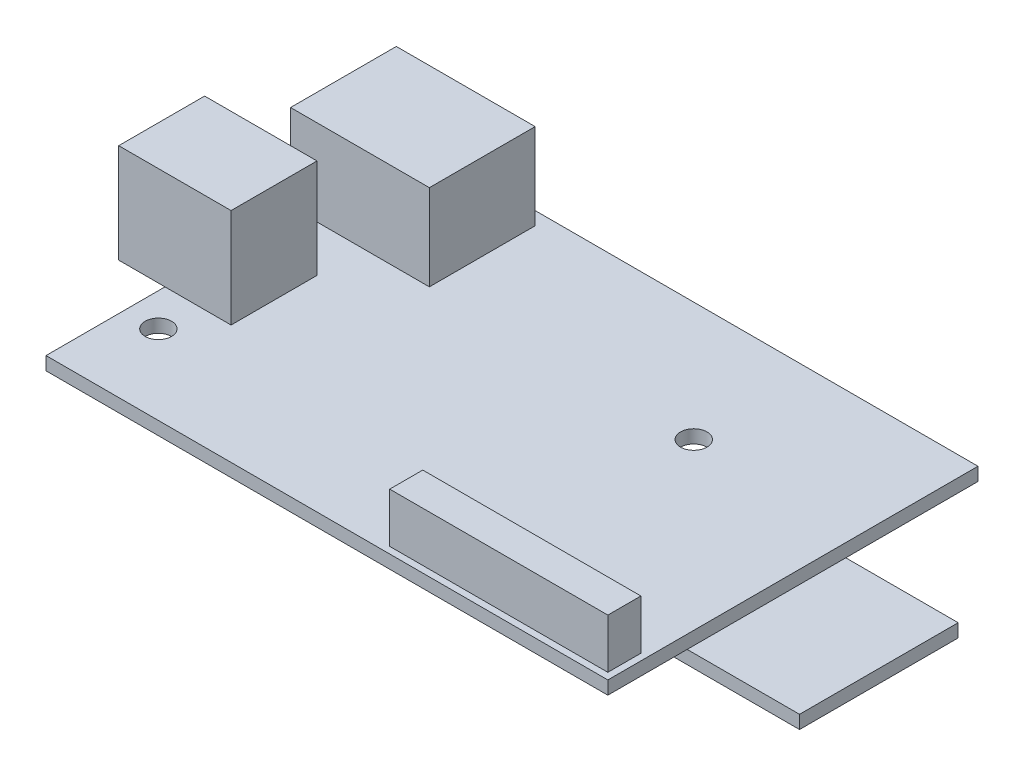
ISO-10303-21;
HEADER;
FILE_DESCRIPTION(('STEP AP214'),'2;1');
FILE_NAME('part.step','',(''),(''),'','','');
FILE_SCHEMA(('AUTOMOTIVE_DESIGN { 1 0 10303 214 1 1 1 1 }'));
ENDSEC;
DATA;
#1=APPLICATION_CONTEXT('core data for automotive mechanical design processes');
#2=APPLICATION_PROTOCOL_DEFINITION('international standard','automotive_design',2000,#1);
#3=PRODUCT_CONTEXT('',#1,'mechanical');
#4=PRODUCT('Part','Part','',(#3));
#5=PRODUCT_RELATED_PRODUCT_CATEGORY('part','',(#4));
#6=PRODUCT_DEFINITION_FORMATION('','',#4);
#7=PRODUCT_DEFINITION_CONTEXT('part definition',#1,'design');
#8=PRODUCT_DEFINITION('design','',#6,#7);
#9=PRODUCT_DEFINITION_SHAPE('','',#8);
#10=(LENGTH_UNIT() NAMED_UNIT(*) SI_UNIT(.MILLI.,.METRE.));
#11=(NAMED_UNIT(*) PLANE_ANGLE_UNIT() SI_UNIT($,.RADIAN.));
#12=(NAMED_UNIT(*) SI_UNIT($,.STERADIAN.) SOLID_ANGLE_UNIT());
#13=UNCERTAINTY_MEASURE_WITH_UNIT(LENGTH_MEASURE(1.E-05),#10,'distance_accuracy_value','');
#14=(GEOMETRIC_REPRESENTATION_CONTEXT(3) GLOBAL_UNCERTAINTY_ASSIGNED_CONTEXT((#13)) GLOBAL_UNIT_ASSIGNED_CONTEXT((#10,
#11,#12)) REPRESENTATION_CONTEXT('',''));
#15=CARTESIAN_POINT('',(0.,0.,0.));
#16=DIRECTION('',(0.,0.,1.));
#17=DIRECTION('',(1.,0.,0.));
#18=AXIS2_PLACEMENT_3D('',#15,#16,#17);
#19=CARTESIAN_POINT('',(0.,2.,0.));
#20=DIRECTION('',(0.,-1.,0.));
#21=DIRECTION('',(0.,0.,-1.));
#22=AXIS2_PLACEMENT_3D('',#19,#20,#21);
#23=PLANE('',#22);
#24=DIRECTION('',(1.,0.,0.));
#25=VECTOR('',#24,1.);
#26=CARTESIAN_POINT('',(-7.,2.,-18.));
#27=LINE('',#26,#25);
#28=CARTESIAN_POINT('',(0.,2.,-18.));
#29=VERTEX_POINT('',#28);
#30=CARTESIAN_POINT('',(10.,2.,-18.));
#31=VERTEX_POINT('',#30);
#32=EDGE_CURVE('E275',#29,#31,#27,.T.);
#33=ORIENTED_EDGE('',*,*,#32,.F.);
#34=DIRECTION('',(0.,0.,1.));
#35=VECTOR('',#34,1.);
#36=CARTESIAN_POINT('',(0.,2.,0.));
#37=LINE('',#36,#35);
#38=CARTESIAN_POINT('',(0.,2.,0.));
#39=VERTEX_POINT('',#38);
#40=EDGE_CURVE('E336',#29,#39,#37,.T.);
#41=ORIENTED_EDGE('',*,*,#40,.T.);
#42=DIRECTION('',(1.,0.,0.));
#43=VECTOR('',#42,1.);
#44=CARTESIAN_POINT('',(0.,2.,0.));
#45=LINE('',#44,#43);
#46=CARTESIAN_POINT('',(85.,2.,0.));
#47=VERTEX_POINT('',#46);
#48=EDGE_CURVE('E334',#39,#47,#45,.T.);
#49=ORIENTED_EDGE('',*,*,#48,.T.);
#50=DIRECTION('',(0.,0.,-1.));
#51=VECTOR('',#50,1.);
#52=CARTESIAN_POINT('',(85.,2.,0.));
#53=LINE('',#52,#51);
#54=CARTESIAN_POINT('',(85.,2.,-56.));
#55=VERTEX_POINT('',#54);
#56=EDGE_CURVE('E338',#47,#55,#53,.T.);
#57=ORIENTED_EDGE('',*,*,#56,.T.);
#58=DIRECTION('',(-1.,0.,0.));
#59=VECTOR('',#58,1.);
#60=CARTESIAN_POINT('',(0.,2.,-56.));
#61=LINE('',#60,#59);
#62=CARTESIAN_POINT('',(0.,2.,-56.));
#63=VERTEX_POINT('',#62);
#64=EDGE_CURVE('E340',#55,#63,#61,.T.);
#65=ORIENTED_EDGE('',*,*,#64,.T.);
#66=CARTESIAN_POINT('',(0.,2.,-54.));
#67=VERTEX_POINT('',#66);
#68=EDGE_CURVE('E331',#63,#67,#37,.T.);
#69=ORIENTED_EDGE('',*,*,#68,.T.);
#70=DIRECTION('',(-1.,0.,0.));
#71=VECTOR('',#70,1.);
#72=CARTESIAN_POINT('',(-1.,2.,-54.));
#73=LINE('',#72,#71);
#74=CARTESIAN_POINT('',(20.,2.,-54.));
#75=VERTEX_POINT('',#74);
#76=EDGE_CURVE('E301',#75,#67,#73,.T.);
#77=ORIENTED_EDGE('',*,*,#76,.F.);
#78=DIRECTION('',(0.,0.,-1.));
#79=VECTOR('',#78,1.);
#80=CARTESIAN_POINT('',(20.,2.,-54.));
#81=LINE('',#80,#79);
#82=CARTESIAN_POINT('',(20.,2.,-38.));
#83=VERTEX_POINT('',#82);
#84=EDGE_CURVE('E313',#83,#75,#81,.T.);
#85=ORIENTED_EDGE('',*,*,#84,.F.);
#86=DIRECTION('',(1.,0.,0.));
#87=VECTOR('',#86,1.);
#88=CARTESIAN_POINT('',(-0.999999999999998,2.,-38.));
#89=LINE('',#88,#87);
#90=CARTESIAN_POINT('',(0.,2.,-38.));
#91=VERTEX_POINT('',#90);
#92=EDGE_CURVE('E43',#91,#83,#89,.T.);
#93=ORIENTED_EDGE('',*,*,#92,.F.);
#94=CARTESIAN_POINT('',(0.,2.,-31.));
#95=VERTEX_POINT('',#94);
#96=EDGE_CURVE('E394',#91,#95,#37,.T.);
#97=ORIENTED_EDGE('',*,*,#96,.T.);
#98=DIRECTION('',(-1.,0.,0.));
#99=VECTOR('',#98,1.);
#100=CARTESIAN_POINT('',(-7.,2.,-31.));
#101=LINE('',#100,#99);
#102=CARTESIAN_POINT('',(10.,2.,-31.));
#103=VERTEX_POINT('',#102);
#104=EDGE_CURVE('E266',#103,#95,#101,.T.);
#105=ORIENTED_EDGE('',*,*,#104,.F.);
#106=DIRECTION('',(0.,0.,-1.));
#107=VECTOR('',#106,1.);
#108=CARTESIAN_POINT('',(10.,2.,-31.));
#109=LINE('',#108,#107);
#110=EDGE_CURVE('E279',#31,#103,#109,.T.);
#111=ORIENTED_EDGE('',*,*,#110,.F.);
#112=EDGE_LOOP('',(#33,#41,#49,#57,#65,#69,#77,#85,#93,#97,#105,#111));
#113=FACE_BOUND('',#112,.T.);
#114=CARTESIAN_POINT('',(60.,2.,-38.));
#115=DIRECTION('',(0.,1.,0.));
#116=DIRECTION('',(0.,0.,1.));
#117=AXIS2_PLACEMENT_3D('',#114,#115,#116);
#118=CIRCLE('',#117,2.);
#119=CARTESIAN_POINT('',(60.,2.,-36.));
#120=VERTEX_POINT('',#119);
#121=EDGE_CURVE('E216',#120,#120,#118,.T.);
#122=ORIENTED_EDGE('',*,*,#121,.F.);
#123=EDGE_LOOP('',(#122));
#124=FACE_BOUND('',#123,.T.);
#125=CARTESIAN_POINT('',(5.,2.,-12.));
#126=DIRECTION('',(0.,1.,0.));
#127=DIRECTION('',(0.,0.,1.));
#128=AXIS2_PLACEMENT_3D('',#125,#126,#127);
#129=CIRCLE('',#128,2.);
#130=CARTESIAN_POINT('',(5.,2.,-10.));
#131=VERTEX_POINT('',#130);
#132=EDGE_CURVE('E222',#131,#131,#129,.T.);
#133=ORIENTED_EDGE('',*,*,#132,.F.);
#134=EDGE_LOOP('',(#133));
#135=FACE_BOUND('',#134,.T.);
#136=DIRECTION('',(0.,0.,1.));
#137=VECTOR('',#136,1.);
#138=CARTESIAN_POINT('',(51.,2.,-6.));
#139=LINE('',#138,#137);
#140=CARTESIAN_POINT('',(51.,2.,-6.));
#141=VERTEX_POINT('',#140);
#142=CARTESIAN_POINT('',(51.,2.,-1.));
#143=VERTEX_POINT('',#142);
#144=EDGE_CURVE('E212',#141,#143,#139,.T.);
#145=ORIENTED_EDGE('',*,*,#144,.F.);
#146=DIRECTION('',(-1.,0.,0.));
#147=VECTOR('',#146,1.);
#148=CARTESIAN_POINT('',(51.,2.,-6.));
#149=LINE('',#148,#147);
#150=CARTESIAN_POINT('',(84.,2.,-6.));
#151=VERTEX_POINT('',#150);
#152=EDGE_CURVE('E209',#151,#141,#149,.T.);
#153=ORIENTED_EDGE('',*,*,#152,.F.);
#154=DIRECTION('',(0.,0.,-1.));
#155=VECTOR('',#154,1.);
#156=CARTESIAN_POINT('',(84.,2.,-6.));
#157=LINE('',#156,#155);
#158=CARTESIAN_POINT('',(84.,2.,-1.));
#159=VERTEX_POINT('',#158);
#160=EDGE_CURVE('E57',#159,#151,#157,.T.);
#161=ORIENTED_EDGE('',*,*,#160,.F.);
#162=DIRECTION('',(1.,0.,0.));
#163=VECTOR('',#162,1.);
#164=CARTESIAN_POINT('',(51.,2.,-1.));
#165=LINE('',#164,#163);
#166=EDGE_CURVE('E52',#143,#159,#165,.T.);
#167=ORIENTED_EDGE('',*,*,#166,.F.);
#168=EDGE_LOOP('',(#145,#153,#161,#167));
#169=FACE_BOUND('',#168,.T.);
#170=ADVANCED_FACE('F34',(#113,#124,#135,#169),#23,.F.);
#171=CARTESIAN_POINT('',(0.,2.,0.));
#172=DIRECTION('',(1.,0.,0.));
#173=DIRECTION('',(0.,0.,-1.));
#174=AXIS2_PLACEMENT_3D('',#171,#172,#173);
#175=PLANE('',#174);
#176=DIRECTION('',(0.,0.,1.));
#177=VECTOR('',#176,1.);
#178=CARTESIAN_POINT('',(0.,0.,0.));
#179=LINE('',#178,#177);
#180=CARTESIAN_POINT('',(0.,0.,-56.));
#181=VERTEX_POINT('',#180);
#182=CARTESIAN_POINT('',(0.,0.,0.));
#183=VERTEX_POINT('',#182);
#184=EDGE_CURVE('E330',#181,#183,#179,.T.);
#185=ORIENTED_EDGE('',*,*,#184,.T.);
#186=DIRECTION('',(0.,-1.,0.));
#187=VECTOR('',#186,1.);
#188=CARTESIAN_POINT('',(0.,2.,0.));
#189=LINE('',#188,#187);
#190=EDGE_CURVE('E38',#39,#183,#189,.T.);
#191=ORIENTED_EDGE('',*,*,#190,.F.);
#192=ORIENTED_EDGE('',*,*,#40,.F.);
#193=EDGE_CURVE('E395',#95,#29,#37,.T.);
#194=ORIENTED_EDGE('',*,*,#193,.F.);
#195=ORIENTED_EDGE('',*,*,#96,.F.);
#196=EDGE_CURVE('E335',#67,#91,#37,.T.);
#197=ORIENTED_EDGE('',*,*,#196,.F.);
#198=ORIENTED_EDGE('',*,*,#68,.F.);
#199=DIRECTION('',(0.,-1.,0.));
#200=VECTOR('',#199,1.);
#201=CARTESIAN_POINT('',(0.,2.,-56.));
#202=LINE('',#201,#200);
#203=EDGE_CURVE('E342',#63,#181,#202,.T.);
#204=ORIENTED_EDGE('',*,*,#203,.T.);
#205=EDGE_LOOP('',(#185,#191,#192,#194,#195,#197,#198,#204));
#206=FACE_BOUND('',#205,.T.);
#207=ADVANCED_FACE('F36',(#206),#175,.F.);
#208=CARTESIAN_POINT('',(0.,2.,0.));
#209=DIRECTION('',(0.,0.,-1.));
#210=DIRECTION('',(-1.,0.,0.));
#211=AXIS2_PLACEMENT_3D('',#208,#209,#210);
#212=PLANE('',#211);
#213=DIRECTION('',(1.,0.,0.));
#214=VECTOR('',#213,1.);
#215=CARTESIAN_POINT('',(0.,0.,0.));
#216=LINE('',#215,#214);
#217=CARTESIAN_POINT('',(85.,0.,0.));
#218=VERTEX_POINT('',#217);
#219=EDGE_CURVE('E345',#183,#218,#216,.T.);
#220=ORIENTED_EDGE('',*,*,#219,.T.);
#221=DIRECTION('',(0.,-1.,0.));
#222=VECTOR('',#221,1.);
#223=CARTESIAN_POINT('',(85.,2.,0.));
#224=LINE('',#223,#222);
#225=EDGE_CURVE('E358',#47,#218,#224,.T.);
#226=ORIENTED_EDGE('',*,*,#225,.F.);
#227=ORIENTED_EDGE('',*,*,#48,.F.);
#228=ORIENTED_EDGE('',*,*,#190,.T.);
#229=EDGE_LOOP('',(#220,#226,#227,#228));
#230=FACE_BOUND('',#229,.T.);
#231=ADVANCED_FACE('F402',(#230),#212,.F.);
#232=CARTESIAN_POINT('',(85.,2.,0.));
#233=DIRECTION('',(-1.,0.,0.));
#234=DIRECTION('',(0.,0.,1.));
#235=AXIS2_PLACEMENT_3D('',#232,#233,#234);
#236=PLANE('',#235);
#237=DIRECTION('',(0.,0.,-1.));
#238=VECTOR('',#237,1.);
#239=CARTESIAN_POINT('',(85.,0.,0.));
#240=LINE('',#239,#238);
#241=CARTESIAN_POINT('',(85.,0.,-12.));
#242=VERTEX_POINT('',#241);
#243=EDGE_CURVE('E348',#218,#242,#240,.T.);
#244=ORIENTED_EDGE('',*,*,#243,.T.);
#245=CARTESIAN_POINT('',(85.,0.,-36.));
#246=VERTEX_POINT('',#245);
#247=EDGE_CURVE('E352',#242,#246,#240,.T.);
#248=ORIENTED_EDGE('',*,*,#247,.T.);
#249=CARTESIAN_POINT('',(85.,0.,-56.));
#250=VERTEX_POINT('',#249);
#251=EDGE_CURVE('E347',#246,#250,#240,.T.);
#252=ORIENTED_EDGE('',*,*,#251,.T.);
#253=DIRECTION('',(0.,-1.,0.));
#254=VECTOR('',#253,1.);
#255=CARTESIAN_POINT('',(85.,2.,-56.));
#256=LINE('',#255,#254);
#257=EDGE_CURVE('E356',#55,#250,#256,.T.);
#258=ORIENTED_EDGE('',*,*,#257,.F.);
#259=ORIENTED_EDGE('',*,*,#56,.F.);
#260=ORIENTED_EDGE('',*,*,#225,.T.);
#261=EDGE_LOOP('',(#244,#248,#252,#258,#259,#260));
#262=FACE_BOUND('',#261,.T.);
#263=ADVANCED_FACE('F410',(#262),#236,.F.);
#264=CARTESIAN_POINT('',(0.,2.,-56.));
#265=DIRECTION('',(0.,0.,1.));
#266=DIRECTION('',(1.,0.,0.));
#267=AXIS2_PLACEMENT_3D('',#264,#265,#266);
#268=PLANE('',#267);
#269=DIRECTION('',(-1.,0.,0.));
#270=VECTOR('',#269,1.);
#271=CARTESIAN_POINT('',(0.,0.,-56.));
#272=LINE('',#271,#270);
#273=EDGE_CURVE('E351',#250,#181,#272,.T.);
#274=ORIENTED_EDGE('',*,*,#273,.T.);
#275=ORIENTED_EDGE('',*,*,#203,.F.);
#276=ORIENTED_EDGE('',*,*,#64,.F.);
#277=ORIENTED_EDGE('',*,*,#257,.T.);
#278=EDGE_LOOP('',(#274,#275,#276,#277));
#279=FACE_BOUND('',#278,.T.);
#280=ADVANCED_FACE('F431',(#279),#268,.F.);
#281=CARTESIAN_POINT('',(0.,0.,0.));
#282=DIRECTION('',(0.,-1.,0.));
#283=DIRECTION('',(0.,0.,-1.));
#284=AXIS2_PLACEMENT_3D('',#281,#282,#283);
#285=PLANE('',#284);
#286=CARTESIAN_POINT('',(5.,0.,-12.));
#287=DIRECTION('',(0.,-1.,0.));
#288=DIRECTION('',(0.,0.,-1.));
#289=AXIS2_PLACEMENT_3D('',#286,#287,#288);
#290=CIRCLE('',#289,2.);
#291=CARTESIAN_POINT('',(5.,0.,-14.));
#292=VERTEX_POINT('',#291);
#293=EDGE_CURVE('E226',#292,#292,#290,.F.);
#294=ORIENTED_EDGE('',*,*,#293,.T.);
#295=EDGE_LOOP('',(#294));
#296=FACE_BOUND('',#295,.T.);
#297=CARTESIAN_POINT('',(60.,0.,-38.));
#298=DIRECTION('',(0.,-1.,0.));
#299=DIRECTION('',(0.,0.,-1.));
#300=AXIS2_PLACEMENT_3D('',#297,#298,#299);
#301=CIRCLE('',#300,2.);
#302=CARTESIAN_POINT('',(60.,0.,-40.));
#303=VERTEX_POINT('',#302);
#304=EDGE_CURVE('E213',#303,#303,#301,.F.);
#305=ORIENTED_EDGE('',*,*,#304,.T.);
#306=EDGE_LOOP('',(#305));
#307=FACE_BOUND('',#306,.T.);
#308=DIRECTION('',(-1.,0.,0.));
#309=VECTOR('',#308,1.);
#310=CARTESIAN_POINT('',(69.,0.,-12.));
#311=LINE('',#310,#309);
#312=CARTESIAN_POINT('',(69.,0.,-12.));
#313=VERTEX_POINT('',#312);
#314=EDGE_CURVE('E11',#242,#313,#311,.T.);
#315=ORIENTED_EDGE('',*,*,#314,.F.);
#316=ORIENTED_EDGE('',*,*,#243,.F.);
#317=ORIENTED_EDGE('',*,*,#219,.F.);
#318=ORIENTED_EDGE('',*,*,#184,.F.);
#319=ORIENTED_EDGE('',*,*,#273,.F.);
#320=ORIENTED_EDGE('',*,*,#251,.F.);
#321=DIRECTION('',(1.,0.,0.));
#322=VECTOR('',#321,1.);
#323=CARTESIAN_POINT('',(69.,0.,-36.));
#324=LINE('',#323,#322);
#325=CARTESIAN_POINT('',(69.,0.,-36.));
#326=VERTEX_POINT('',#325);
#327=EDGE_CURVE('E244',#326,#246,#324,.T.);
#328=ORIENTED_EDGE('',*,*,#327,.F.);
#329=DIRECTION('',(0.,0.,-1.));
#330=VECTOR('',#329,1.);
#331=CARTESIAN_POINT('',(69.,0.,-12.));
#332=LINE('',#331,#330);
#333=EDGE_CURVE('E225',#313,#326,#332,.T.);
#334=ORIENTED_EDGE('',*,*,#333,.F.);
#335=EDGE_LOOP('',(#315,#316,#317,#318,#319,#320,#328,#334));
#336=FACE_BOUND('',#335,.T.);
#337=ADVANCED_FACE('F407',(#296,#307,#336),#285,.T.);
#338=CARTESIAN_POINT('',(0.,2.,0.));
#339=DIRECTION('',(0.,1.,0.));
#340=DIRECTION('',(0.,0.,1.));
#341=AXIS2_PLACEMENT_3D('',#338,#339,#340);
#342=PLANE('',#341);
#343=CARTESIAN_POINT('',(-1.,2.,-54.));
#344=VERTEX_POINT('',#343);
#345=EDGE_CURVE('E316',#67,#344,#73,.T.);
#346=ORIENTED_EDGE('',*,*,#345,.F.);
#347=ORIENTED_EDGE('',*,*,#196,.T.);
#348=CARTESIAN_POINT('',(-0.999999999999998,2.,-38.));
#349=VERTEX_POINT('',#348);
#350=EDGE_CURVE('E310',#349,#91,#89,.T.);
#351=ORIENTED_EDGE('',*,*,#350,.F.);
#352=DIRECTION('',(0.,0.,1.));
#353=VECTOR('',#352,1.);
#354=CARTESIAN_POINT('',(-1.,2.,-54.));
#355=LINE('',#354,#353);
#356=EDGE_CURVE('E296',#344,#349,#355,.T.);
#357=ORIENTED_EDGE('',*,*,#356,.F.);
#358=EDGE_LOOP('',(#346,#347,#351,#357));
#359=FACE_BOUND('',#358,.T.);
#360=ADVANCED_FACE('F390',(#359),#342,.F.);
#361=CARTESIAN_POINT('',(-1.,15.,-54.));
#362=DIRECTION('',(1.,0.,0.));
#363=DIRECTION('',(0.,0.,-1.));
#364=AXIS2_PLACEMENT_3D('',#361,#362,#363);
#365=PLANE('',#364);
#366=ORIENTED_EDGE('',*,*,#356,.T.);
#367=DIRECTION('',(0.,-1.,0.));
#368=VECTOR('',#367,1.);
#369=CARTESIAN_POINT('',(-0.999999999999998,15.,-38.));
#370=LINE('',#369,#368);
#371=CARTESIAN_POINT('',(-0.999999999999998,15.,-38.));
#372=VERTEX_POINT('',#371);
#373=EDGE_CURVE('E327',#372,#349,#370,.T.);
#374=ORIENTED_EDGE('',*,*,#373,.F.);
#375=DIRECTION('',(0.,0.,1.));
#376=VECTOR('',#375,1.);
#377=CARTESIAN_POINT('',(-1.,15.,-54.));
#378=LINE('',#377,#376);
#379=CARTESIAN_POINT('',(-1.,15.,-54.));
#380=VERTEX_POINT('',#379);
#381=EDGE_CURVE('E297',#380,#372,#378,.T.);
#382=ORIENTED_EDGE('',*,*,#381,.F.);
#383=DIRECTION('',(0.,-1.,0.));
#384=VECTOR('',#383,1.);
#385=CARTESIAN_POINT('',(-1.,15.,-54.));
#386=LINE('',#385,#384);
#387=EDGE_CURVE('E307',#380,#344,#386,.T.);
#388=ORIENTED_EDGE('',*,*,#387,.T.);
#389=EDGE_LOOP('',(#366,#374,#382,#388));
#390=FACE_BOUND('',#389,.T.);
#391=ADVANCED_FACE('F387',(#390),#365,.F.);
#392=CARTESIAN_POINT('',(-0.999999999999998,15.,-38.));
#393=DIRECTION('',(0.,0.,-1.));
#394=DIRECTION('',(-1.,0.,0.));
#395=AXIS2_PLACEMENT_3D('',#392,#393,#394);
#396=PLANE('',#395);
#397=ORIENTED_EDGE('',*,*,#350,.T.);
#398=ORIENTED_EDGE('',*,*,#92,.T.);
#399=DIRECTION('',(0.,-1.,0.));
#400=VECTOR('',#399,1.);
#401=CARTESIAN_POINT('',(20.,15.,-38.));
#402=LINE('',#401,#400);
#403=CARTESIAN_POINT('',(20.,15.,-38.));
#404=VERTEX_POINT('',#403);
#405=EDGE_CURVE('E324',#404,#83,#402,.T.);
#406=ORIENTED_EDGE('',*,*,#405,.F.);
#407=DIRECTION('',(1.,0.,0.));
#408=VECTOR('',#407,1.);
#409=CARTESIAN_POINT('',(-0.999999999999998,15.,-38.));
#410=LINE('',#409,#408);
#411=EDGE_CURVE('E300',#372,#404,#410,.T.);
#412=ORIENTED_EDGE('',*,*,#411,.F.);
#413=ORIENTED_EDGE('',*,*,#373,.T.);
#414=EDGE_LOOP('',(#397,#398,#406,#412,#413));
#415=FACE_BOUND('',#414,.T.);
#416=ADVANCED_FACE('F371',(#415),#396,.F.);
#417=CARTESIAN_POINT('',(20.,15.,-54.));
#418=DIRECTION('',(-1.,0.,0.));
#419=DIRECTION('',(0.,0.,1.));
#420=AXIS2_PLACEMENT_3D('',#417,#418,#419);
#421=PLANE('',#420);
#422=ORIENTED_EDGE('',*,*,#84,.T.);
#423=DIRECTION('',(0.,-1.,0.));
#424=VECTOR('',#423,1.);
#425=CARTESIAN_POINT('',(20.,15.,-54.));
#426=LINE('',#425,#424);
#427=CARTESIAN_POINT('',(20.,15.,-54.));
#428=VERTEX_POINT('',#427);
#429=EDGE_CURVE('E321',#428,#75,#426,.T.);
#430=ORIENTED_EDGE('',*,*,#429,.F.);
#431=DIRECTION('',(0.,0.,-1.));
#432=VECTOR('',#431,1.);
#433=CARTESIAN_POINT('',(20.,15.,-54.));
#434=LINE('',#433,#432);
#435=EDGE_CURVE('E303',#404,#428,#434,.T.);
#436=ORIENTED_EDGE('',*,*,#435,.F.);
#437=ORIENTED_EDGE('',*,*,#405,.T.);
#438=EDGE_LOOP('',(#422,#430,#436,#437));
#439=FACE_BOUND('',#438,.T.);
#440=ADVANCED_FACE('F377',(#439),#421,.F.);
#441=CARTESIAN_POINT('',(-1.,15.,-54.));
#442=DIRECTION('',(0.,0.,1.));
#443=DIRECTION('',(1.,0.,0.));
#444=AXIS2_PLACEMENT_3D('',#441,#442,#443);
#445=PLANE('',#444);
#446=ORIENTED_EDGE('',*,*,#76,.T.);
#447=ORIENTED_EDGE('',*,*,#345,.T.);
#448=ORIENTED_EDGE('',*,*,#387,.F.);
#449=DIRECTION('',(-1.,0.,0.));
#450=VECTOR('',#449,1.);
#451=CARTESIAN_POINT('',(-1.,15.,-54.));
#452=LINE('',#451,#450);
#453=EDGE_CURVE('E305',#428,#380,#452,.T.);
#454=ORIENTED_EDGE('',*,*,#453,.F.);
#455=ORIENTED_EDGE('',*,*,#429,.T.);
#456=EDGE_LOOP('',(#446,#447,#448,#454,#455));
#457=FACE_BOUND('',#456,.T.);
#458=ADVANCED_FACE('F433',(#457),#445,.F.);
#459=CARTESIAN_POINT('',(0.,15.,0.));
#460=DIRECTION('',(0.,1.,0.));
#461=DIRECTION('',(0.,0.,1.));
#462=AXIS2_PLACEMENT_3D('',#459,#460,#461);
#463=PLANE('',#462);
#464=ORIENTED_EDGE('',*,*,#381,.T.);
#465=ORIENTED_EDGE('',*,*,#411,.T.);
#466=ORIENTED_EDGE('',*,*,#435,.T.);
#467=ORIENTED_EDGE('',*,*,#453,.T.);
#468=EDGE_LOOP('',(#464,#465,#466,#467));
#469=FACE_BOUND('',#468,.T.);
#470=ADVANCED_FACE('F381',(#469),#463,.T.);
#471=CARTESIAN_POINT('',(0.,2.,0.));
#472=DIRECTION('',(0.,1.,0.));
#473=DIRECTION('',(0.,0.,1.));
#474=AXIS2_PLACEMENT_3D('',#471,#472,#473);
#475=PLANE('',#474);
#476=CARTESIAN_POINT('',(-7.,2.,-31.));
#477=VERTEX_POINT('',#476);
#478=EDGE_CURVE('E282',#95,#477,#101,.T.);
#479=ORIENTED_EDGE('',*,*,#478,.F.);
#480=ORIENTED_EDGE('',*,*,#193,.T.);
#481=CARTESIAN_POINT('',(-7.,2.,-18.));
#482=VERTEX_POINT('',#481);
#483=EDGE_CURVE('E276',#482,#29,#27,.T.);
#484=ORIENTED_EDGE('',*,*,#483,.F.);
#485=DIRECTION('',(0.,0.,1.));
#486=VECTOR('',#485,1.);
#487=CARTESIAN_POINT('',(-7.,2.,-31.));
#488=LINE('',#487,#486);
#489=EDGE_CURVE('E261',#477,#482,#488,.T.);
#490=ORIENTED_EDGE('',*,*,#489,.F.);
#491=EDGE_LOOP('',(#479,#480,#484,#490));
#492=FACE_BOUND('',#491,.T.);
#493=ADVANCED_FACE('F440',(#492),#475,.F.);
#494=CARTESIAN_POINT('',(-7.,17.,-31.));
#495=DIRECTION('',(1.,0.,0.));
#496=DIRECTION('',(0.,0.,-1.));
#497=AXIS2_PLACEMENT_3D('',#494,#495,#496);
#498=PLANE('',#497);
#499=ORIENTED_EDGE('',*,*,#489,.T.);
#500=DIRECTION('',(0.,-1.,0.));
#501=VECTOR('',#500,1.);
#502=CARTESIAN_POINT('',(-7.,17.,-18.));
#503=LINE('',#502,#501);
#504=CARTESIAN_POINT('',(-7.,17.,-18.));
#505=VERTEX_POINT('',#504);
#506=EDGE_CURVE('E293',#505,#482,#503,.T.);
#507=ORIENTED_EDGE('',*,*,#506,.F.);
#508=DIRECTION('',(0.,0.,1.));
#509=VECTOR('',#508,1.);
#510=CARTESIAN_POINT('',(-7.,17.,-31.));
#511=LINE('',#510,#509);
#512=CARTESIAN_POINT('',(-7.,17.,-31.));
#513=VERTEX_POINT('',#512);
#514=EDGE_CURVE('E262',#513,#505,#511,.T.);
#515=ORIENTED_EDGE('',*,*,#514,.F.);
#516=DIRECTION('',(0.,-1.,0.));
#517=VECTOR('',#516,1.);
#518=CARTESIAN_POINT('',(-7.,17.,-31.));
#519=LINE('',#518,#517);
#520=EDGE_CURVE('E272',#513,#477,#519,.T.);
#521=ORIENTED_EDGE('',*,*,#520,.T.);
#522=EDGE_LOOP('',(#499,#507,#515,#521));
#523=FACE_BOUND('',#522,.T.);
#524=ADVANCED_FACE('F521',(#523),#498,.F.);
#525=CARTESIAN_POINT('',(-7.,17.,-18.));
#526=DIRECTION('',(0.,0.,-1.));
#527=DIRECTION('',(-1.,0.,0.));
#528=AXIS2_PLACEMENT_3D('',#525,#526,#527);
#529=PLANE('',#528);
#530=ORIENTED_EDGE('',*,*,#483,.T.);
#531=ORIENTED_EDGE('',*,*,#32,.T.);
#532=DIRECTION('',(0.,-1.,0.));
#533=VECTOR('',#532,1.);
#534=CARTESIAN_POINT('',(10.,17.,-18.));
#535=LINE('',#534,#533);
#536=CARTESIAN_POINT('',(10.,17.,-18.));
#537=VERTEX_POINT('',#536);
#538=EDGE_CURVE('E290',#537,#31,#535,.T.);
#539=ORIENTED_EDGE('',*,*,#538,.F.);
#540=DIRECTION('',(1.,0.,0.));
#541=VECTOR('',#540,1.);
#542=CARTESIAN_POINT('',(-7.,17.,-18.));
#543=LINE('',#542,#541);
#544=EDGE_CURVE('E265',#505,#537,#543,.T.);
#545=ORIENTED_EDGE('',*,*,#544,.F.);
#546=ORIENTED_EDGE('',*,*,#506,.T.);
#547=EDGE_LOOP('',(#530,#531,#539,#545,#546));
#548=FACE_BOUND('',#547,.T.);
#549=ADVANCED_FACE('F530',(#548),#529,.F.);
#550=CARTESIAN_POINT('',(10.,17.,-31.));
#551=DIRECTION('',(-1.,0.,0.));
#552=DIRECTION('',(0.,0.,1.));
#553=AXIS2_PLACEMENT_3D('',#550,#551,#552);
#554=PLANE('',#553);
#555=ORIENTED_EDGE('',*,*,#110,.T.);
#556=DIRECTION('',(0.,-1.,0.));
#557=VECTOR('',#556,1.);
#558=CARTESIAN_POINT('',(10.,17.,-31.));
#559=LINE('',#558,#557);
#560=CARTESIAN_POINT('',(10.,17.,-31.));
#561=VERTEX_POINT('',#560);
#562=EDGE_CURVE('E287',#561,#103,#559,.T.);
#563=ORIENTED_EDGE('',*,*,#562,.F.);
#564=DIRECTION('',(0.,0.,-1.));
#565=VECTOR('',#564,1.);
#566=CARTESIAN_POINT('',(10.,17.,-31.));
#567=LINE('',#566,#565);
#568=EDGE_CURVE('E268',#537,#561,#567,.T.);
#569=ORIENTED_EDGE('',*,*,#568,.F.);
#570=ORIENTED_EDGE('',*,*,#538,.T.);
#571=EDGE_LOOP('',(#555,#563,#569,#570));
#572=FACE_BOUND('',#571,.T.);
#573=ADVANCED_FACE('F540',(#572),#554,.F.);
#574=CARTESIAN_POINT('',(-7.,17.,-31.));
#575=DIRECTION('',(0.,0.,1.));
#576=DIRECTION('',(1.,0.,0.));
#577=AXIS2_PLACEMENT_3D('',#574,#575,#576);
#578=PLANE('',#577);
#579=ORIENTED_EDGE('',*,*,#104,.T.);
#580=ORIENTED_EDGE('',*,*,#478,.T.);
#581=ORIENTED_EDGE('',*,*,#520,.F.);
#582=DIRECTION('',(-1.,0.,0.));
#583=VECTOR('',#582,1.);
#584=CARTESIAN_POINT('',(-7.,17.,-31.));
#585=LINE('',#584,#583);
#586=EDGE_CURVE('E270',#561,#513,#585,.T.);
#587=ORIENTED_EDGE('',*,*,#586,.F.);
#588=ORIENTED_EDGE('',*,*,#562,.T.);
#589=EDGE_LOOP('',(#579,#580,#581,#587,#588));
#590=FACE_BOUND('',#589,.T.);
#591=ADVANCED_FACE('F550',(#590),#578,.F.);
#592=CARTESIAN_POINT('',(0.,17.,0.));
#593=DIRECTION('',(0.,1.,0.));
#594=DIRECTION('',(0.,0.,1.));
#595=AXIS2_PLACEMENT_3D('',#592,#593,#594);
#596=PLANE('',#595);
#597=ORIENTED_EDGE('',*,*,#514,.T.);
#598=ORIENTED_EDGE('',*,*,#544,.T.);
#599=ORIENTED_EDGE('',*,*,#568,.T.);
#600=ORIENTED_EDGE('',*,*,#586,.T.);
#601=EDGE_LOOP('',(#597,#598,#599,#600));
#602=FACE_BOUND('',#601,.T.);
#603=ADVANCED_FACE('F559',(#602),#596,.T.);
#604=CARTESIAN_POINT('',(69.,-2.,-12.));
#605=DIRECTION('',(1.,0.,0.));
#606=DIRECTION('',(0.,0.,-1.));
#607=AXIS2_PLACEMENT_3D('',#604,#605,#606);
#608=PLANE('',#607);
#609=ORIENTED_EDGE('',*,*,#333,.T.);
#610=DIRECTION('',(0.,1.,0.));
#611=VECTOR('',#610,1.);
#612=CARTESIAN_POINT('',(69.,-2.,-36.));
#613=LINE('',#612,#611);
#614=CARTESIAN_POINT('',(69.,-2.,-36.));
#615=VERTEX_POINT('',#614);
#616=EDGE_CURVE('E258',#615,#326,#613,.T.);
#617=ORIENTED_EDGE('',*,*,#616,.F.);
#618=DIRECTION('',(0.,0.,-1.));
#619=VECTOR('',#618,1.);
#620=CARTESIAN_POINT('',(69.,-2.,-12.));
#621=LINE('',#620,#619);
#622=CARTESIAN_POINT('',(69.,-2.,-12.));
#623=VERTEX_POINT('',#622);
#624=EDGE_CURVE('E231',#623,#615,#621,.T.);
#625=ORIENTED_EDGE('',*,*,#624,.F.);
#626=DIRECTION('',(0.,1.,0.));
#627=VECTOR('',#626,1.);
#628=CARTESIAN_POINT('',(69.,-2.,-12.));
#629=LINE('',#628,#627);
#630=EDGE_CURVE('E240',#623,#313,#629,.T.);
#631=ORIENTED_EDGE('',*,*,#630,.T.);
#632=EDGE_LOOP('',(#609,#617,#625,#631));
#633=FACE_BOUND('',#632,.T.);
#634=ADVANCED_FACE('F568',(#633),#608,.F.);
#635=CARTESIAN_POINT('',(69.,-2.,-36.));
#636=DIRECTION('',(0.,0.,1.));
#637=DIRECTION('',(1.,0.,0.));
#638=AXIS2_PLACEMENT_3D('',#635,#636,#637);
#639=PLANE('',#638);
#640=ORIENTED_EDGE('',*,*,#327,.T.);
#641=CARTESIAN_POINT('',(102.,0.,-36.));
#642=VERTEX_POINT('',#641);
#643=EDGE_CURVE('E243',#246,#642,#324,.T.);
#644=ORIENTED_EDGE('',*,*,#643,.T.);
#645=DIRECTION('',(0.,1.,0.));
#646=VECTOR('',#645,1.);
#647=CARTESIAN_POINT('',(102.,-2.,-36.));
#648=LINE('',#647,#646);
#649=CARTESIAN_POINT('',(102.,-2.,-36.));
#650=VERTEX_POINT('',#649);
#651=EDGE_CURVE('E255',#650,#642,#648,.T.);
#652=ORIENTED_EDGE('',*,*,#651,.F.);
#653=DIRECTION('',(1.,0.,0.));
#654=VECTOR('',#653,1.);
#655=CARTESIAN_POINT('',(69.,-2.,-36.));
#656=LINE('',#655,#654);
#657=EDGE_CURVE('E234',#615,#650,#656,.T.);
#658=ORIENTED_EDGE('',*,*,#657,.F.);
#659=ORIENTED_EDGE('',*,*,#616,.T.);
#660=EDGE_LOOP('',(#640,#644,#652,#658,#659));
#661=FACE_BOUND('',#660,.T.);
#662=ADVANCED_FACE('F426',(#661),#639,.F.);
#663=CARTESIAN_POINT('',(102.,-2.,-12.));
#664=DIRECTION('',(-1.,0.,0.));
#665=DIRECTION('',(0.,0.,1.));
#666=AXIS2_PLACEMENT_3D('',#663,#664,#665);
#667=PLANE('',#666);
#668=DIRECTION('',(0.,0.,1.));
#669=VECTOR('',#668,1.);
#670=CARTESIAN_POINT('',(102.,0.,-12.));
#671=LINE('',#670,#669);
#672=CARTESIAN_POINT('',(102.,0.,-12.));
#673=VERTEX_POINT('',#672);
#674=EDGE_CURVE('E247',#642,#673,#671,.T.);
#675=ORIENTED_EDGE('',*,*,#674,.T.);
#676=DIRECTION('',(0.,1.,0.));
#677=VECTOR('',#676,1.);
#678=CARTESIAN_POINT('',(102.,-2.,-12.));
#679=LINE('',#678,#677);
#680=CARTESIAN_POINT('',(102.,-2.,-12.));
#681=VERTEX_POINT('',#680);
#682=EDGE_CURVE('E252',#681,#673,#679,.T.);
#683=ORIENTED_EDGE('',*,*,#682,.F.);
#684=DIRECTION('',(0.,0.,1.));
#685=VECTOR('',#684,1.);
#686=CARTESIAN_POINT('',(102.,-2.,-12.));
#687=LINE('',#686,#685);
#688=EDGE_CURVE('E236',#650,#681,#687,.T.);
#689=ORIENTED_EDGE('',*,*,#688,.F.);
#690=ORIENTED_EDGE('',*,*,#651,.T.);
#691=EDGE_LOOP('',(#675,#683,#689,#690));
#692=FACE_BOUND('',#691,.T.);
#693=ADVANCED_FACE('F423',(#692),#667,.F.);
#694=CARTESIAN_POINT('',(69.,-2.,-12.));
#695=DIRECTION('',(0.,0.,-1.));
#696=DIRECTION('',(-1.,0.,0.));
#697=AXIS2_PLACEMENT_3D('',#694,#695,#696);
#698=PLANE('',#697);
#699=EDGE_CURVE('E45',#673,#242,#311,.T.);
#700=ORIENTED_EDGE('',*,*,#699,.T.);
#701=ORIENTED_EDGE('',*,*,#314,.T.);
#702=ORIENTED_EDGE('',*,*,#630,.F.);
#703=DIRECTION('',(-1.,0.,0.));
#704=VECTOR('',#703,1.);
#705=CARTESIAN_POINT('',(69.,-2.,-12.));
#706=LINE('',#705,#704);
#707=EDGE_CURVE('E238',#681,#623,#706,.T.);
#708=ORIENTED_EDGE('',*,*,#707,.F.);
#709=ORIENTED_EDGE('',*,*,#682,.T.);
#710=EDGE_LOOP('',(#700,#701,#702,#708,#709));
#711=FACE_BOUND('',#710,.T.);
#712=ADVANCED_FACE('F417',(#711),#698,.F.);
#713=CARTESIAN_POINT('',(0.,-2.,0.));
#714=DIRECTION('',(0.,-1.,0.));
#715=DIRECTION('',(0.,0.,-1.));
#716=AXIS2_PLACEMENT_3D('',#713,#714,#715);
#717=PLANE('',#716);
#718=ORIENTED_EDGE('',*,*,#624,.T.);
#719=ORIENTED_EDGE('',*,*,#657,.T.);
#720=ORIENTED_EDGE('',*,*,#688,.T.);
#721=ORIENTED_EDGE('',*,*,#707,.T.);
#722=EDGE_LOOP('',(#718,#719,#720,#721));
#723=FACE_BOUND('',#722,.T.);
#724=ADVANCED_FACE('F596',(#723),#717,.T.);
#725=CARTESIAN_POINT('',(0.,0.,0.));
#726=DIRECTION('',(0.,-1.,0.));
#727=DIRECTION('',(0.,0.,-1.));
#728=AXIS2_PLACEMENT_3D('',#725,#726,#727);
#729=PLANE('',#728);
#730=ORIENTED_EDGE('',*,*,#247,.F.);
#731=ORIENTED_EDGE('',*,*,#699,.F.);
#732=ORIENTED_EDGE('',*,*,#674,.F.);
#733=ORIENTED_EDGE('',*,*,#643,.F.);
#734=EDGE_LOOP('',(#730,#731,#732,#733));
#735=FACE_BOUND('',#734,.T.);
#736=ADVANCED_FACE('F414',(#735),#729,.F.);
#737=CARTESIAN_POINT('',(60.,-2.001,-38.));
#738=DIRECTION('',(0.,1.,0.));
#739=DIRECTION('',(0.,0.,1.));
#740=AXIS2_PLACEMENT_3D('',#737,#738,#739);
#741=CYLINDRICAL_SURFACE('',#740,2.);
#742=ORIENTED_EDGE('',*,*,#304,.F.);
#743=EDGE_LOOP('',(#742));
#744=FACE_BOUND('',#743,.T.);
#745=ORIENTED_EDGE('',*,*,#121,.T.);
#746=EDGE_LOOP('',(#745));
#747=FACE_BOUND('',#746,.T.);
#748=ADVANCED_FACE('F609',(#744,#747),#741,.F.);
#749=CARTESIAN_POINT('',(5.,-2.001,-12.));
#750=DIRECTION('',(0.,1.,0.));
#751=DIRECTION('',(0.,0.,1.));
#752=AXIS2_PLACEMENT_3D('',#749,#750,#751);
#753=CYLINDRICAL_SURFACE('',#752,2.);
#754=ORIENTED_EDGE('',*,*,#293,.F.);
#755=EDGE_LOOP('',(#754));
#756=FACE_BOUND('',#755,.T.);
#757=ORIENTED_EDGE('',*,*,#132,.T.);
#758=EDGE_LOOP('',(#757));
#759=FACE_BOUND('',#758,.T.);
#760=ADVANCED_FACE('F615',(#756,#759),#753,.F.);
#761=CARTESIAN_POINT('',(51.,9.5,-6.));
#762=DIRECTION('',(1.,0.,0.));
#763=DIRECTION('',(0.,0.,-1.));
#764=AXIS2_PLACEMENT_3D('',#761,#762,#763);
#765=PLANE('',#764);
#766=ORIENTED_EDGE('',*,*,#144,.T.);
#767=DIRECTION('',(0.,-1.,0.));
#768=VECTOR('',#767,1.);
#769=CARTESIAN_POINT('',(51.,9.5,-1.));
#770=LINE('',#769,#768);
#771=CARTESIAN_POINT('',(51.,9.5,-1.));
#772=VERTEX_POINT('',#771);
#773=EDGE_CURVE('E193',#772,#143,#770,.T.);
#774=ORIENTED_EDGE('',*,*,#773,.F.);
#775=DIRECTION('',(0.,0.,1.));
#776=VECTOR('',#775,1.);
#777=CARTESIAN_POINT('',(51.,9.5,-6.));
#778=LINE('',#777,#776);
#779=CARTESIAN_POINT('',(51.,9.5,-6.));
#780=VERTEX_POINT('',#779);
#781=EDGE_CURVE('E200',#780,#772,#778,.T.);
#782=ORIENTED_EDGE('',*,*,#781,.F.);
#783=DIRECTION('',(0.,-1.,0.));
#784=VECTOR('',#783,1.);
#785=CARTESIAN_POINT('',(51.,9.5,-6.));
#786=LINE('',#785,#784);
#787=EDGE_CURVE('E692',#780,#141,#786,.T.);
#788=ORIENTED_EDGE('',*,*,#787,.T.);
#789=EDGE_LOOP('',(#766,#774,#782,#788));
#790=FACE_BOUND('',#789,.T.);
#791=ADVANCED_FACE('F211',(#790),#765,.F.);
#792=CARTESIAN_POINT('',(51.,9.5,-1.));
#793=DIRECTION('',(0.,0.,-1.));
#794=DIRECTION('',(-1.,0.,0.));
#795=AXIS2_PLACEMENT_3D('',#792,#793,#794);
#796=PLANE('',#795);
#797=ORIENTED_EDGE('',*,*,#166,.T.);
#798=DIRECTION('',(0.,-1.,0.));
#799=VECTOR('',#798,1.);
#800=CARTESIAN_POINT('',(84.,9.5,-1.));
#801=LINE('',#800,#799);
#802=CARTESIAN_POINT('',(84.,9.5,-1.));
#803=VERTEX_POINT('',#802);
#804=EDGE_CURVE('E196',#803,#159,#801,.T.);
#805=ORIENTED_EDGE('',*,*,#804,.F.);
#806=DIRECTION('',(1.,0.,0.));
#807=VECTOR('',#806,1.);
#808=CARTESIAN_POINT('',(51.,9.5,-1.));
#809=LINE('',#808,#807);
#810=EDGE_CURVE('E189',#772,#803,#809,.T.);
#811=ORIENTED_EDGE('',*,*,#810,.F.);
#812=ORIENTED_EDGE('',*,*,#773,.T.);
#813=EDGE_LOOP('',(#797,#805,#811,#812));
#814=FACE_BOUND('',#813,.T.);
#815=ADVANCED_FACE('F191',(#814),#796,.F.);
#816=CARTESIAN_POINT('',(84.,9.5,-6.));
#817=DIRECTION('',(-1.,0.,0.));
#818=DIRECTION('',(0.,0.,1.));
#819=AXIS2_PLACEMENT_3D('',#816,#817,#818);
#820=PLANE('',#819);
#821=ORIENTED_EDGE('',*,*,#160,.T.);
#822=DIRECTION('',(0.,-1.,0.));
#823=VECTOR('',#822,1.);
#824=CARTESIAN_POINT('',(84.,9.5,-6.));
#825=LINE('',#824,#823);
#826=CARTESIAN_POINT('',(84.,9.5,-6.));
#827=VERTEX_POINT('',#826);
#828=EDGE_CURVE('E218',#827,#151,#825,.T.);
#829=ORIENTED_EDGE('',*,*,#828,.F.);
#830=DIRECTION('',(0.,0.,-1.));
#831=VECTOR('',#830,1.);
#832=CARTESIAN_POINT('',(84.,9.5,-6.));
#833=LINE('',#832,#831);
#834=EDGE_CURVE('E199',#803,#827,#833,.T.);
#835=ORIENTED_EDGE('',*,*,#834,.F.);
#836=ORIENTED_EDGE('',*,*,#804,.T.);
#837=EDGE_LOOP('',(#821,#829,#835,#836));
#838=FACE_BOUND('',#837,.T.);
#839=ADVANCED_FACE('F636',(#838),#820,.F.);
#840=CARTESIAN_POINT('',(51.,9.5,-6.));
#841=DIRECTION('',(0.,0.,1.));
#842=DIRECTION('',(1.,0.,0.));
#843=AXIS2_PLACEMENT_3D('',#840,#841,#842);
#844=PLANE('',#843);
#845=ORIENTED_EDGE('',*,*,#152,.T.);
#846=ORIENTED_EDGE('',*,*,#787,.F.);
#847=DIRECTION('',(-1.,0.,0.));
#848=VECTOR('',#847,1.);
#849=CARTESIAN_POINT('',(51.,9.5,-6.));
#850=LINE('',#849,#848);
#851=EDGE_CURVE('E205',#827,#780,#850,.T.);
#852=ORIENTED_EDGE('',*,*,#851,.F.);
#853=ORIENTED_EDGE('',*,*,#828,.T.);
#854=EDGE_LOOP('',(#845,#846,#852,#853));
#855=FACE_BOUND('',#854,.T.);
#856=ADVANCED_FACE('F643',(#855),#844,.F.);
#857=CARTESIAN_POINT('',(0.,9.5,0.));
#858=DIRECTION('',(0.,1.,0.));
#859=DIRECTION('',(0.,0.,1.));
#860=AXIS2_PLACEMENT_3D('',#857,#858,#859);
#861=PLANE('',#860);
#862=ORIENTED_EDGE('',*,*,#781,.T.);
#863=ORIENTED_EDGE('',*,*,#810,.T.);
#864=ORIENTED_EDGE('',*,*,#834,.T.);
#865=ORIENTED_EDGE('',*,*,#851,.T.);
#866=EDGE_LOOP('',(#862,#863,#864,#865));
#867=FACE_BOUND('',#866,.T.);
#868=ADVANCED_FACE('F203',(#867),#861,.T.);
#869=CLOSED_SHELL('',(#170,#207,#231,#263,#280,#337,#360,#391,#416,#440,#458,#470,#493,#524,
#549,#573,#591,#603,#634,#662,#693,#712,#724,#736,#748,#760,#791,#815,#839,#856,#868));
#870=MANIFOLD_SOLID_BREP('B2',#869);
#871=ADVANCED_BREP_SHAPE_REPRESENTATION('',(#18,#870),#14);
#872=SHAPE_DEFINITION_REPRESENTATION(#9,#871);
ENDSEC;
END-ISO-10303-21;
